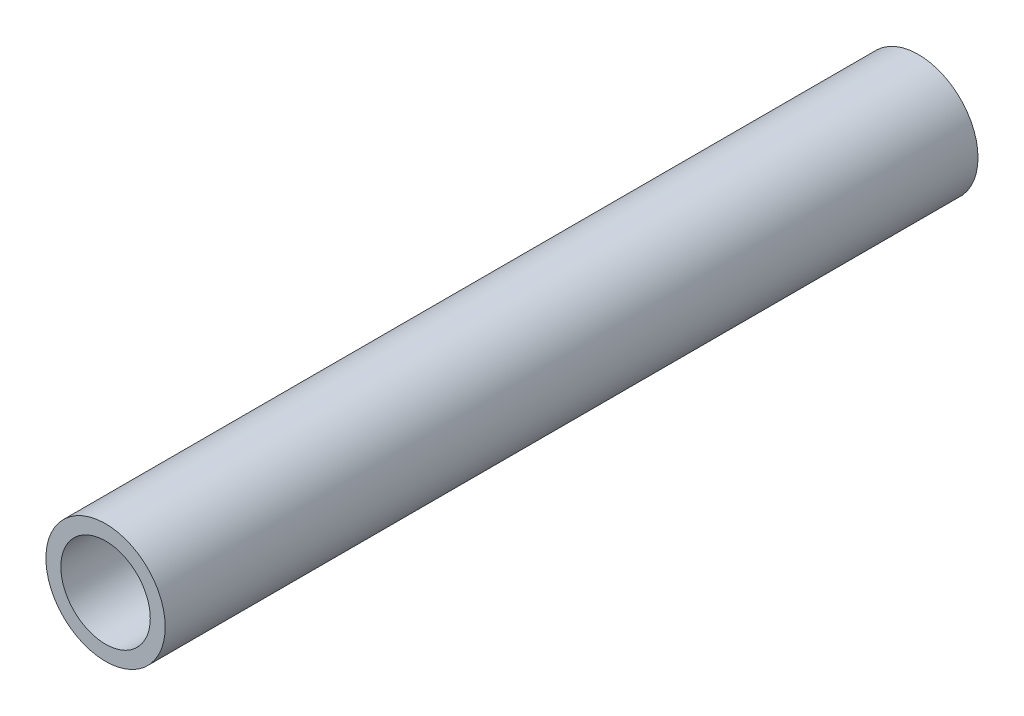
ISO-10303-21;
HEADER;
FILE_DESCRIPTION(('STEP AP214'),'2;1');
FILE_NAME('part.step','',(''),(''),'','','');
FILE_SCHEMA(('AUTOMOTIVE_DESIGN { 1 0 10303 214 1 1 1 1 }'));
ENDSEC;
DATA;
#1=APPLICATION_CONTEXT('core data for automotive mechanical design processes');
#2=APPLICATION_PROTOCOL_DEFINITION('international standard','automotive_design',2000,#1);
#3=PRODUCT_CONTEXT('',#1,'mechanical');
#4=PRODUCT('Part','Part','',(#3));
#5=PRODUCT_RELATED_PRODUCT_CATEGORY('part','',(#4));
#6=PRODUCT_DEFINITION_FORMATION('','',#4);
#7=PRODUCT_DEFINITION_CONTEXT('part definition',#1,'design');
#8=PRODUCT_DEFINITION('design','',#6,#7);
#9=PRODUCT_DEFINITION_SHAPE('','',#8);
#10=(LENGTH_UNIT() NAMED_UNIT(*) SI_UNIT(.MILLI.,.METRE.));
#11=(NAMED_UNIT(*) PLANE_ANGLE_UNIT() SI_UNIT($,.RADIAN.));
#12=(NAMED_UNIT(*) SI_UNIT($,.STERADIAN.) SOLID_ANGLE_UNIT());
#13=UNCERTAINTY_MEASURE_WITH_UNIT(LENGTH_MEASURE(1.E-05),#10,'distance_accuracy_value','');
#14=(GEOMETRIC_REPRESENTATION_CONTEXT(3) GLOBAL_UNCERTAINTY_ASSIGNED_CONTEXT((#13)) GLOBAL_UNIT_ASSIGNED_CONTEXT((#10,
#11,#12)) REPRESENTATION_CONTEXT('',''));
#15=CARTESIAN_POINT('',(0.,0.,0.));
#16=DIRECTION('',(0.,0.,1.));
#17=DIRECTION('',(1.,0.,0.));
#18=AXIS2_PLACEMENT_3D('',#15,#16,#17);
#19=CARTESIAN_POINT('',(0.,0.,54.5));
#20=DIRECTION('',(0.,0.,-1.));
#21=DIRECTION('',(-1.,0.,0.));
#22=AXIS2_PLACEMENT_3D('',#19,#20,#21);
#23=CYLINDRICAL_SURFACE('',#22,4.);
#24=CARTESIAN_POINT('',(0.,0.,54.5));
#25=DIRECTION('',(0.,0.,1.));
#26=DIRECTION('',(1.,0.,0.));
#27=AXIS2_PLACEMENT_3D('',#24,#25,#26);
#28=CIRCLE('',#27,4.);
#29=CARTESIAN_POINT('',(4.,0.,54.5));
#30=VERTEX_POINT('',#29);
#31=EDGE_CURVE('E10',#30,#30,#28,.T.);
#32=ORIENTED_EDGE('',*,*,#31,.F.);
#33=EDGE_LOOP('',(#32));
#34=FACE_BOUND('',#33,.T.);
#35=CARTESIAN_POINT('',(0.,0.,0.));
#36=DIRECTION('',(0.,0.,1.));
#37=DIRECTION('',(1.,0.,0.));
#38=AXIS2_PLACEMENT_3D('',#35,#36,#37);
#39=CIRCLE('',#38,4.);
#40=CARTESIAN_POINT('',(4.,0.,0.));
#41=VERTEX_POINT('',#40);
#42=EDGE_CURVE('E34',#41,#41,#39,.T.);
#43=ORIENTED_EDGE('',*,*,#42,.T.);
#44=EDGE_LOOP('',(#43));
#45=FACE_BOUND('',#44,.T.);
#46=ADVANCED_FACE('F31',(#34,#45),#23,.T.);
#47=CARTESIAN_POINT('',(0.,0.,54.5));
#48=DIRECTION('',(0.,0.,1.));
#49=DIRECTION('',(1.,0.,0.));
#50=AXIS2_PLACEMENT_3D('',#47,#48,#49);
#51=PLANE('',#50);
#52=CARTESIAN_POINT('',(0.,0.,54.5));
#53=DIRECTION('',(0.,0.,1.));
#54=DIRECTION('',(1.,0.,0.));
#55=AXIS2_PLACEMENT_3D('',#52,#53,#54);
#56=CIRCLE('',#55,3.);
#57=CARTESIAN_POINT('',(3.,0.,54.5));
#58=VERTEX_POINT('',#57);
#59=EDGE_CURVE('E43',#58,#58,#56,.T.);
#60=ORIENTED_EDGE('',*,*,#59,.F.);
#61=EDGE_LOOP('',(#60));
#62=FACE_BOUND('',#61,.T.);
#63=ORIENTED_EDGE('',*,*,#31,.T.);
#64=EDGE_LOOP('',(#63));
#65=FACE_BOUND('',#64,.T.);
#66=ADVANCED_FACE('F58',(#62,#65),#51,.T.);
#67=CARTESIAN_POINT('',(0.,0.,0.));
#68=DIRECTION('',(0.,0.,1.));
#69=DIRECTION('',(1.,0.,0.));
#70=AXIS2_PLACEMENT_3D('',#67,#68,#69);
#71=PLANE('',#70);
#72=ORIENTED_EDGE('',*,*,#42,.F.);
#73=EDGE_LOOP('',(#72));
#74=FACE_BOUND('',#73,.T.);
#75=ADVANCED_FACE('F54',(#74),#71,.F.);
#76=CARTESIAN_POINT('',(0.,0.,34.));
#77=DIRECTION('',(0.,0.,1.));
#78=DIRECTION('',(1.,0.,0.));
#79=AXIS2_PLACEMENT_3D('',#76,#77,#78);
#80=CYLINDRICAL_SURFACE('',#79,3.);
#81=CARTESIAN_POINT('',(0.,0.,34.));
#82=DIRECTION('',(0.,0.,1.));
#83=DIRECTION('',(1.,0.,0.));
#84=AXIS2_PLACEMENT_3D('',#81,#82,#83);
#85=CIRCLE('',#84,3.);
#86=CARTESIAN_POINT('',(3.,0.,34.));
#87=VERTEX_POINT('',#86);
#88=EDGE_CURVE('E41',#87,#87,#85,.T.);
#89=ORIENTED_EDGE('',*,*,#88,.F.);
#90=EDGE_LOOP('',(#89));
#91=FACE_BOUND('',#90,.T.);
#92=ORIENTED_EDGE('',*,*,#59,.T.);
#93=EDGE_LOOP('',(#92));
#94=FACE_BOUND('',#93,.T.);
#95=ADVANCED_FACE('F51',(#91,#94),#80,.F.);
#96=CARTESIAN_POINT('',(0.,0.,34.));
#97=DIRECTION('',(0.,0.,1.));
#98=DIRECTION('',(1.,0.,0.));
#99=AXIS2_PLACEMENT_3D('',#96,#97,#98);
#100=PLANE('',#99);
#101=ORIENTED_EDGE('',*,*,#88,.T.);
#102=EDGE_LOOP('',(#101));
#103=FACE_BOUND('',#102,.T.);
#104=ADVANCED_FACE('F49',(#103),#100,.T.);
#105=CLOSED_SHELL('',(#46,#66,#75,#95,#104));
#106=MANIFOLD_SOLID_BREP('B2',#105);
#107=ADVANCED_BREP_SHAPE_REPRESENTATION('',(#18,#106),#14);
#108=SHAPE_DEFINITION_REPRESENTATION(#9,#107);
ENDSEC;
END-ISO-10303-21;
